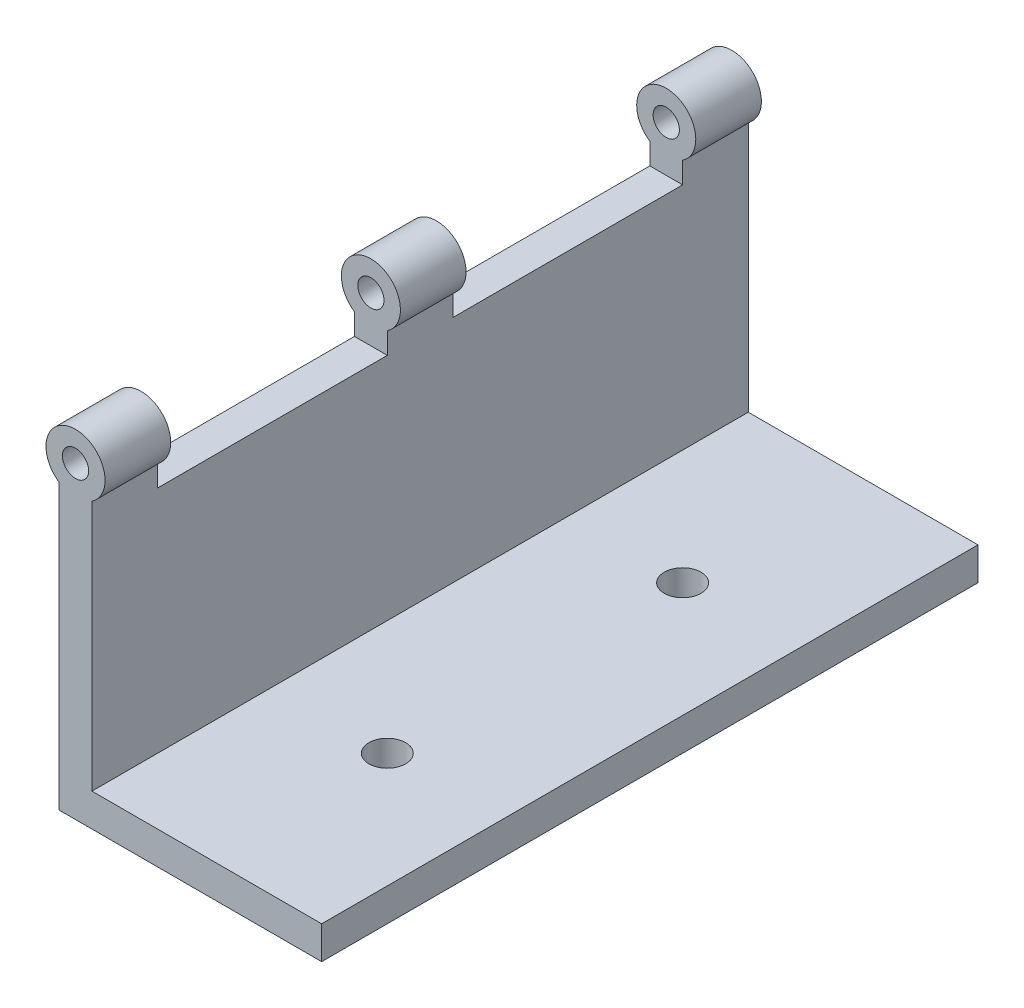
ISO-10303-21;
HEADER;
FILE_DESCRIPTION(('STEP AP214'),'2;1');
FILE_NAME('part.step','',(''),(''),'','','');
FILE_SCHEMA(('AUTOMOTIVE_DESIGN { 1 0 10303 214 1 1 1 1 }'));
ENDSEC;
DATA;
#1=APPLICATION_CONTEXT('core data for automotive mechanical design processes');
#2=APPLICATION_PROTOCOL_DEFINITION('international standard','automotive_design',2000,#1);
#3=PRODUCT_CONTEXT('',#1,'mechanical');
#4=PRODUCT('Part','Part','',(#3));
#5=PRODUCT_RELATED_PRODUCT_CATEGORY('part','',(#4));
#6=PRODUCT_DEFINITION_FORMATION('','',#4);
#7=PRODUCT_DEFINITION_CONTEXT('part definition',#1,'design');
#8=PRODUCT_DEFINITION('design','',#6,#7);
#9=PRODUCT_DEFINITION_SHAPE('','',#8);
#10=(LENGTH_UNIT() NAMED_UNIT(*) SI_UNIT(.MILLI.,.METRE.));
#11=(NAMED_UNIT(*) PLANE_ANGLE_UNIT() SI_UNIT($,.RADIAN.));
#12=(NAMED_UNIT(*) SI_UNIT($,.STERADIAN.) SOLID_ANGLE_UNIT());
#13=UNCERTAINTY_MEASURE_WITH_UNIT(LENGTH_MEASURE(1.E-05),#10,'distance_accuracy_value','');
#14=(GEOMETRIC_REPRESENTATION_CONTEXT(3) GLOBAL_UNCERTAINTY_ASSIGNED_CONTEXT((#13)) GLOBAL_UNIT_ASSIGNED_CONTEXT((#10,
#11,#12)) REPRESENTATION_CONTEXT('',''));
#15=CARTESIAN_POINT('',(0.,0.,0.));
#16=DIRECTION('',(0.,0.,1.));
#17=DIRECTION('',(1.,0.,0.));
#18=AXIS2_PLACEMENT_3D('',#15,#16,#17);
#19=CARTESIAN_POINT('',(0.,40.,50.));
#20=DIRECTION('',(0.,-1.,0.));
#21=DIRECTION('',(0.,0.,-1.));
#22=AXIS2_PLACEMENT_3D('',#19,#20,#21);
#23=PLANE('',#22);
#24=DIRECTION('',(1.,0.,0.));
#25=VECTOR('',#24,1.);
#26=CARTESIAN_POINT('',(0.,40.,-40.));
#27=LINE('',#26,#25);
#28=CARTESIAN_POINT('',(0.,40.,-40.));
#29=VERTEX_POINT('',#28);
#30=CARTESIAN_POINT('',(5.,40.,-40.));
#31=VERTEX_POINT('',#30);
#32=EDGE_CURVE('E159',#29,#31,#27,.T.);
#33=ORIENTED_EDGE('',*,*,#32,.F.);
#34=DIRECTION('',(0.,0.,-1.));
#35=VECTOR('',#34,1.);
#36=CARTESIAN_POINT('',(0.,40.,50.));
#37=LINE('',#36,#35);
#38=CARTESIAN_POINT('',(0.,40.,-5.));
#39=VERTEX_POINT('',#38);
#40=EDGE_CURVE('E360',#39,#29,#37,.T.);
#41=ORIENTED_EDGE('',*,*,#40,.F.);
#42=DIRECTION('',(1.,0.,0.));
#43=VECTOR('',#42,1.);
#44=CARTESIAN_POINT('',(0.,40.,-5.));
#45=LINE('',#44,#43);
#46=CARTESIAN_POINT('',(5.,40.,-5.));
#47=VERTEX_POINT('',#46);
#48=EDGE_CURVE('E321',#39,#47,#45,.T.);
#49=ORIENTED_EDGE('',*,*,#48,.T.);
#50=DIRECTION('',(0.,0.,-1.));
#51=VECTOR('',#50,1.);
#52=CARTESIAN_POINT('',(5.,40.,50.));
#53=LINE('',#52,#51);
#54=EDGE_CURVE('E155',#47,#31,#53,.T.);
#55=ORIENTED_EDGE('',*,*,#54,.T.);
#56=EDGE_LOOP('',(#33,#41,#49,#55));
#57=FACE_BOUND('',#56,.T.);
#58=ADVANCED_FACE('F140',(#57),#23,.F.);
#59=DIRECTION('',(1.,0.,0.));
#60=VECTOR('',#59,1.);
#61=CARTESIAN_POINT('',(0.,40.,40.));
#62=LINE('',#61,#60);
#63=CARTESIAN_POINT('',(0.,40.,40.));
#64=VERTEX_POINT('',#63);
#65=CARTESIAN_POINT('',(5.,40.,40.));
#66=VERTEX_POINT('',#65);
#67=EDGE_CURVE('E287',#64,#66,#62,.T.);
#68=ORIENTED_EDGE('',*,*,#67,.T.);
#69=CARTESIAN_POINT('',(5.,40.,5.));
#70=VERTEX_POINT('',#69);
#71=EDGE_CURVE('E363',#66,#70,#53,.T.);
#72=ORIENTED_EDGE('',*,*,#71,.T.);
#73=DIRECTION('',(1.,0.,0.));
#74=VECTOR('',#73,1.);
#75=CARTESIAN_POINT('',(0.,40.,5.));
#76=LINE('',#75,#74);
#77=CARTESIAN_POINT('',(0.,40.,5.));
#78=VERTEX_POINT('',#77);
#79=EDGE_CURVE('E310',#78,#70,#76,.T.);
#80=ORIENTED_EDGE('',*,*,#79,.F.);
#81=EDGE_CURVE('E361',#64,#78,#37,.T.);
#82=ORIENTED_EDGE('',*,*,#81,.F.);
#83=EDGE_LOOP('',(#68,#72,#80,#82));
#84=FACE_BOUND('',#83,.T.);
#85=ADVANCED_FACE('F425',(#84),#23,.F.);
#86=CARTESIAN_POINT('',(0.,0.,50.));
#87=DIRECTION('',(0.,1.,0.));
#88=DIRECTION('',(0.,0.,1.));
#89=AXIS2_PLACEMENT_3D('',#86,#87,#88);
#90=PLANE('',#89);
#91=CARTESIAN_POINT('',(22.5,0.,22.5));
#92=DIRECTION('',(0.,1.,0.));
#93=DIRECTION('',(0.,0.,1.));
#94=AXIS2_PLACEMENT_3D('',#91,#92,#93);
#95=CIRCLE('',#94,2.8);
#96=CARTESIAN_POINT('',(22.5,0.,25.3));
#97=VERTEX_POINT('',#96);
#98=EDGE_CURVE('E387',#97,#97,#95,.T.);
#99=ORIENTED_EDGE('',*,*,#98,.T.);
#100=EDGE_LOOP('',(#99));
#101=FACE_BOUND('',#100,.T.);
#102=CARTESIAN_POINT('',(22.5,0.,-22.5));
#103=DIRECTION('',(0.,1.,0.));
#104=DIRECTION('',(0.,0.,1.));
#105=AXIS2_PLACEMENT_3D('',#102,#103,#104);
#106=CIRCLE('',#105,2.8);
#107=CARTESIAN_POINT('',(22.5,0.,-19.7));
#108=VERTEX_POINT('',#107);
#109=EDGE_CURVE('E391',#108,#108,#106,.T.);
#110=ORIENTED_EDGE('',*,*,#109,.T.);
#111=EDGE_LOOP('',(#110));
#112=FACE_BOUND('',#111,.T.);
#113=DIRECTION('',(1.,0.,0.));
#114=VECTOR('',#113,1.);
#115=CARTESIAN_POINT('',(0.,0.,-50.));
#116=LINE('',#115,#114);
#117=CARTESIAN_POINT('',(0.,0.,-50.));
#118=VERTEX_POINT('',#117);
#119=CARTESIAN_POINT('',(40.,0.,-50.));
#120=VERTEX_POINT('',#119);
#121=EDGE_CURVE('E329',#118,#120,#116,.T.);
#122=ORIENTED_EDGE('',*,*,#121,.T.);
#123=DIRECTION('',(0.,0.,-1.));
#124=VECTOR('',#123,1.);
#125=CARTESIAN_POINT('',(40.,0.,50.));
#126=LINE('',#125,#124);
#127=CARTESIAN_POINT('',(40.,0.,50.));
#128=VERTEX_POINT('',#127);
#129=EDGE_CURVE('E12',#128,#120,#126,.T.);
#130=ORIENTED_EDGE('',*,*,#129,.F.);
#131=DIRECTION('',(1.,0.,0.));
#132=VECTOR('',#131,1.);
#133=CARTESIAN_POINT('',(0.,0.,50.));
#134=LINE('',#133,#132);
#135=CARTESIAN_POINT('',(0.,0.,50.));
#136=VERTEX_POINT('',#135);
#137=EDGE_CURVE('E340',#136,#128,#134,.T.);
#138=ORIENTED_EDGE('',*,*,#137,.F.);
#139=DIRECTION('',(0.,0.,-1.));
#140=VECTOR('',#139,1.);
#141=CARTESIAN_POINT('',(0.,0.,50.));
#142=LINE('',#141,#140);
#143=EDGE_CURVE('E351',#136,#118,#142,.T.);
#144=ORIENTED_EDGE('',*,*,#143,.T.);
#145=EDGE_LOOP('',(#122,#130,#138,#144));
#146=FACE_BOUND('',#145,.T.);
#147=ADVANCED_FACE('F142',(#101,#112,#146),#90,.F.);
#148=CARTESIAN_POINT('',(40.,5.,50.));
#149=DIRECTION('',(-1.,0.,0.));
#150=DIRECTION('',(0.,0.,1.));
#151=AXIS2_PLACEMENT_3D('',#148,#149,#150);
#152=PLANE('',#151);
#153=DIRECTION('',(0.,1.,0.));
#154=VECTOR('',#153,1.);
#155=CARTESIAN_POINT('',(40.,5.,-50.));
#156=LINE('',#155,#154);
#157=CARTESIAN_POINT('',(40.,5.,-50.));
#158=VERTEX_POINT('',#157);
#159=EDGE_CURVE('E354',#120,#158,#156,.T.);
#160=ORIENTED_EDGE('',*,*,#159,.T.);
#161=DIRECTION('',(0.,0.,-1.));
#162=VECTOR('',#161,1.);
#163=CARTESIAN_POINT('',(40.,5.,50.));
#164=LINE('',#163,#162);
#165=CARTESIAN_POINT('',(40.,5.,50.));
#166=VERTEX_POINT('',#165);
#167=EDGE_CURVE('E148',#166,#158,#164,.T.);
#168=ORIENTED_EDGE('',*,*,#167,.F.);
#169=DIRECTION('',(0.,1.,0.));
#170=VECTOR('',#169,1.);
#171=CARTESIAN_POINT('',(40.,5.,50.));
#172=LINE('',#171,#170);
#173=EDGE_CURVE('E343',#128,#166,#172,.T.);
#174=ORIENTED_EDGE('',*,*,#173,.F.);
#175=ORIENTED_EDGE('',*,*,#129,.T.);
#176=EDGE_LOOP('',(#160,#168,#174,#175));
#177=FACE_BOUND('',#176,.T.);
#178=ADVANCED_FACE('F372',(#177),#152,.F.);
#179=CARTESIAN_POINT('',(5.,5.,50.));
#180=DIRECTION('',(0.,-1.,0.));
#181=DIRECTION('',(0.,0.,-1.));
#182=AXIS2_PLACEMENT_3D('',#179,#180,#181);
#183=PLANE('',#182);
#184=CARTESIAN_POINT('',(22.5,5.,22.5));
#185=DIRECTION('',(0.,1.,0.));
#186=DIRECTION('',(0.,0.,1.));
#187=AXIS2_PLACEMENT_3D('',#184,#185,#186);
#188=CIRCLE('',#187,2.8);
#189=CARTESIAN_POINT('',(22.5,5.,25.3));
#190=VERTEX_POINT('',#189);
#191=EDGE_CURVE('E394',#190,#190,#188,.T.);
#192=ORIENTED_EDGE('',*,*,#191,.F.);
#193=EDGE_LOOP('',(#192));
#194=FACE_BOUND('',#193,.T.);
#195=CARTESIAN_POINT('',(22.5,5.,-22.5));
#196=DIRECTION('',(0.,1.,0.));
#197=DIRECTION('',(0.,0.,1.));
#198=AXIS2_PLACEMENT_3D('',#195,#196,#197);
#199=CIRCLE('',#198,2.8);
#200=CARTESIAN_POINT('',(22.5,5.,-19.7));
#201=VERTEX_POINT('',#200);
#202=EDGE_CURVE('E388',#201,#201,#199,.T.);
#203=ORIENTED_EDGE('',*,*,#202,.F.);
#204=EDGE_LOOP('',(#203));
#205=FACE_BOUND('',#204,.T.);
#206=DIRECTION('',(-1.,0.,0.));
#207=VECTOR('',#206,1.);
#208=CARTESIAN_POINT('',(5.,5.,-50.));
#209=LINE('',#208,#207);
#210=CARTESIAN_POINT('',(5.,5.,-50.));
#211=VERTEX_POINT('',#210);
#212=EDGE_CURVE('E252',#158,#211,#209,.T.);
#213=ORIENTED_EDGE('',*,*,#212,.T.);
#214=DIRECTION('',(0.,0.,-1.));
#215=VECTOR('',#214,1.);
#216=CARTESIAN_POINT('',(5.,5.,50.));
#217=LINE('',#216,#215);
#218=CARTESIAN_POINT('',(5.,5.,50.));
#219=VERTEX_POINT('',#218);
#220=EDGE_CURVE('E248',#219,#211,#217,.T.);
#221=ORIENTED_EDGE('',*,*,#220,.F.);
#222=DIRECTION('',(-1.,0.,0.));
#223=VECTOR('',#222,1.);
#224=CARTESIAN_POINT('',(5.,5.,50.));
#225=LINE('',#224,#223);
#226=EDGE_CURVE('E345',#166,#219,#225,.T.);
#227=ORIENTED_EDGE('',*,*,#226,.F.);
#228=ORIENTED_EDGE('',*,*,#167,.T.);
#229=EDGE_LOOP('',(#213,#221,#227,#228));
#230=FACE_BOUND('',#229,.T.);
#231=ADVANCED_FACE('F369',(#194,#205,#230),#183,.F.);
#232=CARTESIAN_POINT('',(5.,5.,50.));
#233=DIRECTION('',(-1.,0.,0.));
#234=DIRECTION('',(0.,0.,1.));
#235=AXIS2_PLACEMENT_3D('',#232,#233,#234);
#236=PLANE('',#235);
#237=DIRECTION('',(0.,1.,0.));
#238=VECTOR('',#237,1.);
#239=CARTESIAN_POINT('',(5.,5.,-50.));
#240=LINE('',#239,#238);
#241=CARTESIAN_POINT('',(5.,43.2583426132261,-50.));
#242=VERTEX_POINT('',#241);
#243=EDGE_CURVE('E240',#211,#242,#240,.T.);
#244=ORIENTED_EDGE('',*,*,#243,.T.);
#245=DIRECTION('',(0.,0.,-1.));
#246=VECTOR('',#245,1.);
#247=CARTESIAN_POINT('',(5.,43.2583426132261,-40.));
#248=LINE('',#247,#246);
#249=CARTESIAN_POINT('',(5.,43.2583426132261,-40.));
#250=VERTEX_POINT('',#249);
#251=EDGE_CURVE('E245',#250,#242,#248,.T.);
#252=ORIENTED_EDGE('',*,*,#251,.F.);
#253=DIRECTION('',(0.,1.,0.));
#254=VECTOR('',#253,1.);
#255=CARTESIAN_POINT('',(5.,40.,-40.));
#256=LINE('',#255,#254);
#257=EDGE_CURVE('E272',#31,#250,#256,.T.);
#258=ORIENTED_EDGE('',*,*,#257,.F.);
#259=ORIENTED_EDGE('',*,*,#54,.F.);
#260=DIRECTION('',(0.,1.,0.));
#261=VECTOR('',#260,1.);
#262=CARTESIAN_POINT('',(5.00000000000001,0.,-5.));
#263=LINE('',#262,#261);
#264=CARTESIAN_POINT('',(5.,43.2583426132261,-5.));
#265=VERTEX_POINT('',#264);
#266=EDGE_CURVE('E311',#47,#265,#263,.T.);
#267=ORIENTED_EDGE('',*,*,#266,.T.);
#268=DIRECTION('',(0.,0.,-1.));
#269=VECTOR('',#268,1.);
#270=CARTESIAN_POINT('',(5.,43.2583426132261,5.));
#271=LINE('',#270,#269);
#272=CARTESIAN_POINT('',(5.,43.2583426132261,5.));
#273=VERTEX_POINT('',#272);
#274=EDGE_CURVE('E317',#273,#265,#271,.T.);
#275=ORIENTED_EDGE('',*,*,#274,.F.);
#276=DIRECTION('',(0.,1.,0.));
#277=VECTOR('',#276,1.);
#278=CARTESIAN_POINT('',(5.00000000000001,0.,5.));
#279=LINE('',#278,#277);
#280=EDGE_CURVE('E314',#70,#273,#279,.T.);
#281=ORIENTED_EDGE('',*,*,#280,.F.);
#282=ORIENTED_EDGE('',*,*,#71,.F.);
#283=DIRECTION('',(0.,1.,0.));
#284=VECTOR('',#283,1.);
#285=CARTESIAN_POINT('',(5.,40.,40.));
#286=LINE('',#285,#284);
#287=CARTESIAN_POINT('',(5.,43.2583426132261,40.));
#288=VERTEX_POINT('',#287);
#289=EDGE_CURVE('E302',#66,#288,#286,.T.);
#290=ORIENTED_EDGE('',*,*,#289,.T.);
#291=DIRECTION('',(0.,0.,1.));
#292=VECTOR('',#291,1.);
#293=CARTESIAN_POINT('',(5.,43.2583426132261,40.));
#294=LINE('',#293,#292);
#295=CARTESIAN_POINT('',(5.,43.2583426132261,50.));
#296=VERTEX_POINT('',#295);
#297=EDGE_CURVE('E291',#288,#296,#294,.T.);
#298=ORIENTED_EDGE('',*,*,#297,.T.);
#299=DIRECTION('',(0.,1.,0.));
#300=VECTOR('',#299,1.);
#301=CARTESIAN_POINT('',(5.,5.,50.));
#302=LINE('',#301,#300);
#303=EDGE_CURVE('E347',#219,#296,#302,.T.);
#304=ORIENTED_EDGE('',*,*,#303,.F.);
#305=ORIENTED_EDGE('',*,*,#220,.T.);
#306=EDGE_LOOP('',(#244,#252,#258,#259,#267,#275,#281,#282,#290,#298,#304,#305));
#307=FACE_BOUND('',#306,.T.);
#308=ADVANCED_FACE('F242',(#307),#236,.F.);
#309=CARTESIAN_POINT('',(0.,0.,50.));
#310=DIRECTION('',(1.,0.,0.));
#311=DIRECTION('',(0.,0.,-1.));
#312=AXIS2_PLACEMENT_3D('',#309,#310,#311);
#313=PLANE('',#312);
#314=DIRECTION('',(0.,-1.,0.));
#315=VECTOR('',#314,1.);
#316=CARTESIAN_POINT('',(0.,0.,-50.));
#317=LINE('',#316,#315);
#318=CARTESIAN_POINT('',(0.,43.2583426132261,-50.));
#319=VERTEX_POINT('',#318);
#320=EDGE_CURVE('E251',#319,#118,#317,.T.);
#321=ORIENTED_EDGE('',*,*,#320,.T.);
#322=ORIENTED_EDGE('',*,*,#143,.F.);
#323=DIRECTION('',(0.,-1.,0.));
#324=VECTOR('',#323,1.);
#325=CARTESIAN_POINT('',(0.,0.,50.));
#326=LINE('',#325,#324);
#327=CARTESIAN_POINT('',(0.,43.2583426132261,50.));
#328=VERTEX_POINT('',#327);
#329=EDGE_CURVE('E349',#328,#136,#326,.T.);
#330=ORIENTED_EDGE('',*,*,#329,.F.);
#331=DIRECTION('',(0.,0.,1.));
#332=VECTOR('',#331,1.);
#333=CARTESIAN_POINT('',(0.,43.2583426132261,40.));
#334=LINE('',#333,#332);
#335=CARTESIAN_POINT('',(0.,43.2583426132261,40.));
#336=VERTEX_POINT('',#335);
#337=EDGE_CURVE('E296',#336,#328,#334,.T.);
#338=ORIENTED_EDGE('',*,*,#337,.F.);
#339=DIRECTION('',(0.,1.,0.));
#340=VECTOR('',#339,1.);
#341=CARTESIAN_POINT('',(0.,40.,40.));
#342=LINE('',#341,#340);
#343=EDGE_CURVE('E278',#64,#336,#342,.T.);
#344=ORIENTED_EDGE('',*,*,#343,.F.);
#345=ORIENTED_EDGE('',*,*,#81,.T.);
#346=DIRECTION('',(0.,1.,0.));
#347=VECTOR('',#346,1.);
#348=CARTESIAN_POINT('',(0.,0.,5.));
#349=LINE('',#348,#347);
#350=CARTESIAN_POINT('',(0.,43.2583426132261,5.));
#351=VERTEX_POINT('',#350);
#352=EDGE_CURVE('E307',#78,#351,#349,.T.);
#353=ORIENTED_EDGE('',*,*,#352,.T.);
#354=DIRECTION('',(0.,0.,-1.));
#355=VECTOR('',#354,1.);
#356=CARTESIAN_POINT('',(0.,43.2583426132261,5.));
#357=LINE('',#356,#355);
#358=CARTESIAN_POINT('',(0.,43.2583426132261,-5.));
#359=VERTEX_POINT('',#358);
#360=EDGE_CURVE('E327',#351,#359,#357,.T.);
#361=ORIENTED_EDGE('',*,*,#360,.T.);
#362=DIRECTION('',(0.,1.,0.));
#363=VECTOR('',#362,1.);
#364=CARTESIAN_POINT('',(0.,0.,-5.));
#365=LINE('',#364,#363);
#366=EDGE_CURVE('E318',#39,#359,#365,.T.);
#367=ORIENTED_EDGE('',*,*,#366,.F.);
#368=ORIENTED_EDGE('',*,*,#40,.T.);
#369=DIRECTION('',(0.,1.,0.));
#370=VECTOR('',#369,1.);
#371=CARTESIAN_POINT('',(0.,40.,-40.));
#372=LINE('',#371,#370);
#373=CARTESIAN_POINT('',(0.,43.2583426132261,-40.));
#374=VERTEX_POINT('',#373);
#375=EDGE_CURVE('E380',#29,#374,#372,.T.);
#376=ORIENTED_EDGE('',*,*,#375,.T.);
#377=DIRECTION('',(0.,0.,-1.));
#378=VECTOR('',#377,1.);
#379=CARTESIAN_POINT('',(0.,43.2583426132261,-40.));
#380=LINE('',#379,#378);
#381=EDGE_CURVE('E268',#374,#319,#380,.T.);
#382=ORIENTED_EDGE('',*,*,#381,.T.);
#383=EDGE_LOOP('',(#321,#322,#330,#338,#344,#345,#353,#361,#367,#368,#376,#382));
#384=FACE_BOUND('',#383,.T.);
#385=ADVANCED_FACE('F377',(#384),#313,.F.);
#386=CARTESIAN_POINT('',(0.,0.,50.));
#387=DIRECTION('',(0.,0.,-1.));
#388=DIRECTION('',(-1.,0.,0.));
#389=AXIS2_PLACEMENT_3D('',#386,#387,#388);
#390=PLANE('',#389);
#391=ORIENTED_EDGE('',*,*,#137,.T.);
#392=ORIENTED_EDGE('',*,*,#173,.T.);
#393=ORIENTED_EDGE('',*,*,#226,.T.);
#394=ORIENTED_EDGE('',*,*,#303,.T.);
#395=CARTESIAN_POINT('',(2.5,47.,50.));
#396=DIRECTION('',(0.,0.,1.));
#397=DIRECTION('',(1.,0.,0.));
#398=AXIS2_PLACEMENT_3D('',#395,#396,#397);
#399=CIRCLE('',#398,4.5);
#400=EDGE_CURVE('E283',#296,#328,#399,.T.);
#401=ORIENTED_EDGE('',*,*,#400,.T.);
#402=ORIENTED_EDGE('',*,*,#329,.T.);
#403=EDGE_LOOP('',(#391,#392,#393,#394,#401,#402));
#404=FACE_BOUND('',#403,.T.);
#405=CARTESIAN_POINT('',(2.5,47.,50.));
#406=DIRECTION('',(0.,0.,1.));
#407=DIRECTION('',(1.,0.,0.));
#408=AXIS2_PLACEMENT_3D('',#405,#406,#407);
#409=CIRCLE('',#408,2.);
#410=CARTESIAN_POINT('',(4.5,47.,50.));
#411=VERTEX_POINT('',#410);
#412=EDGE_CURVE('E284',#411,#411,#409,.T.);
#413=ORIENTED_EDGE('',*,*,#412,.F.);
#414=EDGE_LOOP('',(#413));
#415=FACE_BOUND('',#414,.T.);
#416=ADVANCED_FACE('F459',(#404,#415),#390,.F.);
#417=CARTESIAN_POINT('',(0.,0.,-50.));
#418=DIRECTION('',(0.,0.,-1.));
#419=DIRECTION('',(-1.,0.,0.));
#420=AXIS2_PLACEMENT_3D('',#417,#418,#419);
#421=PLANE('',#420);
#422=ORIENTED_EDGE('',*,*,#121,.F.);
#423=ORIENTED_EDGE('',*,*,#320,.F.);
#424=CARTESIAN_POINT('',(2.5,47.,-50.));
#425=DIRECTION('',(0.,0.,1.));
#426=DIRECTION('',(1.,0.,0.));
#427=AXIS2_PLACEMENT_3D('',#424,#425,#426);
#428=CIRCLE('',#427,4.5);
#429=EDGE_CURVE('E255',#242,#319,#428,.T.);
#430=ORIENTED_EDGE('',*,*,#429,.F.);
#431=ORIENTED_EDGE('',*,*,#243,.F.);
#432=ORIENTED_EDGE('',*,*,#212,.F.);
#433=ORIENTED_EDGE('',*,*,#159,.F.);
#434=EDGE_LOOP('',(#422,#423,#430,#431,#432,#433));
#435=FACE_BOUND('',#434,.T.);
#436=CARTESIAN_POINT('',(2.5,47.,-50.));
#437=DIRECTION('',(0.,0.,1.));
#438=DIRECTION('',(1.,0.,0.));
#439=AXIS2_PLACEMENT_3D('',#436,#437,#438);
#440=CIRCLE('',#439,2.);
#441=CARTESIAN_POINT('',(4.5,47.,-50.));
#442=VERTEX_POINT('',#441);
#443=EDGE_CURVE('E267',#442,#442,#440,.T.);
#444=ORIENTED_EDGE('',*,*,#443,.T.);
#445=EDGE_LOOP('',(#444));
#446=FACE_BOUND('',#445,.T.);
#447=ADVANCED_FACE('F257',(#435,#446),#421,.T.);
#448=CARTESIAN_POINT('',(0.,0.,-5.));
#449=DIRECTION('',(0.,0.,1.));
#450=DIRECTION('',(1.,0.,0.));
#451=AXIS2_PLACEMENT_3D('',#448,#449,#450);
#452=PLANE('',#451);
#453=ORIENTED_EDGE('',*,*,#366,.T.);
#454=CARTESIAN_POINT('',(2.5,47.,-5.));
#455=DIRECTION('',(0.,0.,1.));
#456=DIRECTION('',(1.,0.,0.));
#457=AXIS2_PLACEMENT_3D('',#454,#455,#456);
#458=CIRCLE('',#457,4.50000000000001);
#459=EDGE_CURVE('E333',#265,#359,#458,.T.);
#460=ORIENTED_EDGE('',*,*,#459,.F.);
#461=ORIENTED_EDGE('',*,*,#266,.F.);
#462=ORIENTED_EDGE('',*,*,#48,.F.);
#463=EDGE_LOOP('',(#453,#460,#461,#462));
#464=FACE_BOUND('',#463,.T.);
#465=CARTESIAN_POINT('',(2.5,47.,-5.));
#466=DIRECTION('',(0.,0.,1.));
#467=DIRECTION('',(1.,0.,0.));
#468=AXIS2_PLACEMENT_3D('',#465,#466,#467);
#469=CIRCLE('',#468,2.00000000000001);
#470=CARTESIAN_POINT('',(4.5,47.,-5.));
#471=VERTEX_POINT('',#470);
#472=EDGE_CURVE('E299',#471,#471,#469,.T.);
#473=ORIENTED_EDGE('',*,*,#472,.T.);
#474=EDGE_LOOP('',(#473));
#475=FACE_BOUND('',#474,.T.);
#476=ADVANCED_FACE('F525',(#464,#475),#452,.F.);
#477=CARTESIAN_POINT('',(0.,0.,5.));
#478=DIRECTION('',(0.,0.,1.));
#479=DIRECTION('',(1.,0.,0.));
#480=AXIS2_PLACEMENT_3D('',#477,#478,#479);
#481=PLANE('',#480);
#482=ORIENTED_EDGE('',*,*,#280,.T.);
#483=CARTESIAN_POINT('',(2.5,47.,5.));
#484=DIRECTION('',(0.,0.,1.));
#485=DIRECTION('',(1.,0.,0.));
#486=AXIS2_PLACEMENT_3D('',#483,#484,#485);
#487=CIRCLE('',#486,4.50000000000001);
#488=EDGE_CURVE('E322',#273,#351,#487,.T.);
#489=ORIENTED_EDGE('',*,*,#488,.T.);
#490=ORIENTED_EDGE('',*,*,#352,.F.);
#491=ORIENTED_EDGE('',*,*,#79,.T.);
#492=EDGE_LOOP('',(#482,#489,#490,#491));
#493=FACE_BOUND('',#492,.T.);
#494=CARTESIAN_POINT('',(2.5,47.,5.));
#495=DIRECTION('',(0.,0.,1.));
#496=DIRECTION('',(1.,0.,0.));
#497=AXIS2_PLACEMENT_3D('',#494,#495,#496);
#498=CIRCLE('',#497,2.00000000000001);
#499=CARTESIAN_POINT('',(4.5,47.,5.));
#500=VERTEX_POINT('',#499);
#501=EDGE_CURVE('E330',#500,#500,#498,.T.);
#502=ORIENTED_EDGE('',*,*,#501,.F.);
#503=EDGE_LOOP('',(#502));
#504=FACE_BOUND('',#503,.T.);
#505=ADVANCED_FACE('F491',(#493,#504),#481,.T.);
#506=CARTESIAN_POINT('',(2.5,47.,5.));
#507=DIRECTION('',(0.,0.,-1.));
#508=DIRECTION('',(-1.,0.,0.));
#509=AXIS2_PLACEMENT_3D('',#506,#507,#508);
#510=CYLINDRICAL_SURFACE('',#509,2.00000000000001);
#511=ORIENTED_EDGE('',*,*,#501,.T.);
#512=EDGE_LOOP('',(#511));
#513=FACE_BOUND('',#512,.T.);
#514=ORIENTED_EDGE('',*,*,#472,.F.);
#515=EDGE_LOOP('',(#514));
#516=FACE_BOUND('',#515,.T.);
#517=ADVANCED_FACE('F603',(#513,#516),#510,.F.);
#518=CARTESIAN_POINT('',(2.5,47.,5.));
#519=DIRECTION('',(0.,0.,-1.));
#520=DIRECTION('',(-1.,0.,0.));
#521=AXIS2_PLACEMENT_3D('',#518,#519,#520);
#522=CYLINDRICAL_SURFACE('',#521,4.50000000000001);
#523=ORIENTED_EDGE('',*,*,#274,.T.);
#524=ORIENTED_EDGE('',*,*,#459,.T.);
#525=ORIENTED_EDGE('',*,*,#360,.F.);
#526=ORIENTED_EDGE('',*,*,#488,.F.);
#527=EDGE_LOOP('',(#523,#524,#525,#526));
#528=FACE_BOUND('',#527,.T.);
#529=ADVANCED_FACE('F455',(#528),#522,.T.);
#530=CARTESIAN_POINT('',(2.5,47.,40.));
#531=DIRECTION('',(0.,0.,1.));
#532=DIRECTION('',(1.,0.,0.));
#533=AXIS2_PLACEMENT_3D('',#530,#531,#532);
#534=PLANE('',#533);
#535=CARTESIAN_POINT('',(2.5,47.,40.));
#536=DIRECTION('',(0.,0.,1.));
#537=DIRECTION('',(1.,0.,0.));
#538=AXIS2_PLACEMENT_3D('',#535,#536,#537);
#539=CIRCLE('',#538,4.5);
#540=EDGE_CURVE('E288',#288,#336,#539,.T.);
#541=ORIENTED_EDGE('',*,*,#540,.F.);
#542=ORIENTED_EDGE('',*,*,#289,.F.);
#543=ORIENTED_EDGE('',*,*,#67,.F.);
#544=ORIENTED_EDGE('',*,*,#343,.T.);
#545=EDGE_LOOP('',(#541,#542,#543,#544));
#546=FACE_BOUND('',#545,.T.);
#547=CARTESIAN_POINT('',(2.5,47.,40.));
#548=DIRECTION('',(0.,0.,1.));
#549=DIRECTION('',(1.,0.,0.));
#550=AXIS2_PLACEMENT_3D('',#547,#548,#549);
#551=CIRCLE('',#550,2.);
#552=CARTESIAN_POINT('',(4.5,47.,40.));
#553=VERTEX_POINT('',#552);
#554=EDGE_CURVE('E280',#553,#553,#551,.T.);
#555=ORIENTED_EDGE('',*,*,#554,.T.);
#556=EDGE_LOOP('',(#555));
#557=FACE_BOUND('',#556,.T.);
#558=ADVANCED_FACE('F473',(#546,#557),#534,.F.);
#559=CARTESIAN_POINT('',(2.5,47.,40.));
#560=DIRECTION('',(0.,0.,1.));
#561=DIRECTION('',(1.,0.,0.));
#562=AXIS2_PLACEMENT_3D('',#559,#560,#561);
#563=CYLINDRICAL_SURFACE('',#562,4.5);
#564=ORIENTED_EDGE('',*,*,#540,.T.);
#565=ORIENTED_EDGE('',*,*,#337,.T.);
#566=ORIENTED_EDGE('',*,*,#400,.F.);
#567=ORIENTED_EDGE('',*,*,#297,.F.);
#568=EDGE_LOOP('',(#564,#565,#566,#567));
#569=FACE_BOUND('',#568,.T.);
#570=ADVANCED_FACE('F478',(#569),#563,.T.);
#571=CARTESIAN_POINT('',(2.5,47.,40.));
#572=DIRECTION('',(0.,0.,1.));
#573=DIRECTION('',(1.,0.,0.));
#574=AXIS2_PLACEMENT_3D('',#571,#572,#573);
#575=CYLINDRICAL_SURFACE('',#574,2.);
#576=ORIENTED_EDGE('',*,*,#554,.F.);
#577=EDGE_LOOP('',(#576));
#578=FACE_BOUND('',#577,.T.);
#579=ORIENTED_EDGE('',*,*,#412,.T.);
#580=EDGE_LOOP('',(#579));
#581=FACE_BOUND('',#580,.T.);
#582=ADVANCED_FACE('F481',(#578,#581),#575,.F.);
#583=CARTESIAN_POINT('',(2.5,47.,-40.));
#584=DIRECTION('',(0.,0.,-1.));
#585=DIRECTION('',(1.,0.,0.));
#586=AXIS2_PLACEMENT_3D('',#583,#584,#585);
#587=PLANE('',#586);
#588=CARTESIAN_POINT('',(2.5,47.,-40.));
#589=DIRECTION('',(0.,0.,1.));
#590=DIRECTION('',(1.,0.,0.));
#591=AXIS2_PLACEMENT_3D('',#588,#589,#590);
#592=CIRCLE('',#591,4.5);
#593=EDGE_CURVE('E261',#250,#374,#592,.T.);
#594=ORIENTED_EDGE('',*,*,#593,.T.);
#595=ORIENTED_EDGE('',*,*,#375,.F.);
#596=ORIENTED_EDGE('',*,*,#32,.T.);
#597=ORIENTED_EDGE('',*,*,#257,.T.);
#598=EDGE_LOOP('',(#594,#595,#596,#597));
#599=FACE_BOUND('',#598,.T.);
#600=CARTESIAN_POINT('',(2.5,47.,-40.));
#601=DIRECTION('',(0.,0.,1.));
#602=DIRECTION('',(1.,0.,0.));
#603=AXIS2_PLACEMENT_3D('',#600,#601,#602);
#604=CIRCLE('',#603,2.);
#605=CARTESIAN_POINT('',(4.5,47.,-40.));
#606=VERTEX_POINT('',#605);
#607=EDGE_CURVE('E262',#606,#606,#604,.T.);
#608=ORIENTED_EDGE('',*,*,#607,.F.);
#609=EDGE_LOOP('',(#608));
#610=FACE_BOUND('',#609,.T.);
#611=ADVANCED_FACE('F382',(#599,#610),#587,.F.);
#612=CARTESIAN_POINT('',(2.5,47.,-40.));
#613=DIRECTION('',(0.,0.,-1.));
#614=DIRECTION('',(-1.,0.,0.));
#615=AXIS2_PLACEMENT_3D('',#612,#613,#614);
#616=CYLINDRICAL_SURFACE('',#615,4.5);
#617=ORIENTED_EDGE('',*,*,#593,.F.);
#618=ORIENTED_EDGE('',*,*,#251,.T.);
#619=ORIENTED_EDGE('',*,*,#429,.T.);
#620=ORIENTED_EDGE('',*,*,#381,.F.);
#621=EDGE_LOOP('',(#617,#618,#619,#620));
#622=FACE_BOUND('',#621,.T.);
#623=ADVANCED_FACE('F264',(#622),#616,.T.);
#624=CARTESIAN_POINT('',(2.5,47.,-40.));
#625=DIRECTION('',(0.,0.,-1.));
#626=DIRECTION('',(-1.,0.,0.));
#627=AXIS2_PLACEMENT_3D('',#624,#625,#626);
#628=CYLINDRICAL_SURFACE('',#627,2.);
#629=ORIENTED_EDGE('',*,*,#607,.T.);
#630=EDGE_LOOP('',(#629));
#631=FACE_BOUND('',#630,.T.);
#632=ORIENTED_EDGE('',*,*,#443,.F.);
#633=EDGE_LOOP('',(#632));
#634=FACE_BOUND('',#633,.T.);
#635=ADVANCED_FACE('F415',(#631,#634),#628,.F.);
#636=CARTESIAN_POINT('',(22.5,0.,-22.5));
#637=DIRECTION('',(0.,1.,0.));
#638=DIRECTION('',(0.,0.,1.));
#639=AXIS2_PLACEMENT_3D('',#636,#637,#638);
#640=CYLINDRICAL_SURFACE('',#639,2.8);
#641=ORIENTED_EDGE('',*,*,#109,.F.);
#642=EDGE_LOOP('',(#641));
#643=FACE_BOUND('',#642,.T.);
#644=ORIENTED_EDGE('',*,*,#202,.T.);
#645=EDGE_LOOP('',(#644));
#646=FACE_BOUND('',#645,.T.);
#647=ADVANCED_FACE('F405',(#643,#646),#640,.F.);
#648=CARTESIAN_POINT('',(22.5,0.,22.5));
#649=DIRECTION('',(0.,1.,0.));
#650=DIRECTION('',(0.,0.,1.));
#651=AXIS2_PLACEMENT_3D('',#648,#649,#650);
#652=CYLINDRICAL_SURFACE('',#651,2.8);
#653=ORIENTED_EDGE('',*,*,#98,.F.);
#654=EDGE_LOOP('',(#653));
#655=FACE_BOUND('',#654,.T.);
#656=ORIENTED_EDGE('',*,*,#191,.T.);
#657=EDGE_LOOP('',(#656));
#658=FACE_BOUND('',#657,.T.);
#659=ADVANCED_FACE('F402',(#655,#658),#652,.F.);
#660=CLOSED_SHELL('',(#58,#85,#147,#178,#231,#308,#385,#416,#447,#476,#505,#517,#529,#558,#570,
#582,#611,#623,#635,#647,#659));
#661=MANIFOLD_SOLID_BREP('B2',#660);
#662=ADVANCED_BREP_SHAPE_REPRESENTATION('',(#18,#661),#14);
#663=SHAPE_DEFINITION_REPRESENTATION(#9,#662);
ENDSEC;
END-ISO-10303-21;
